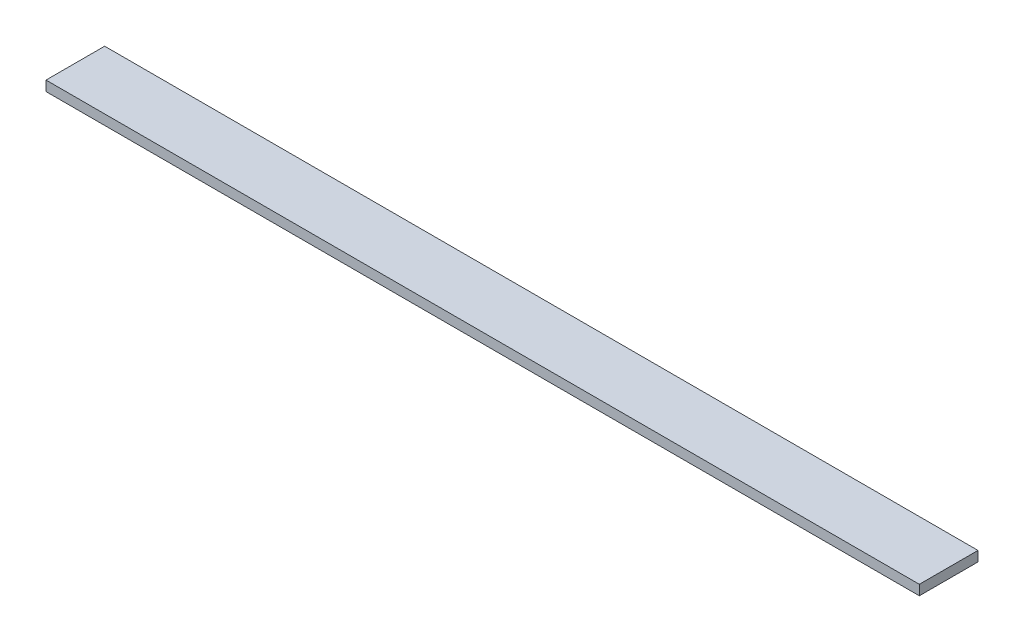
ISO-10303-21;
HEADER;
FILE_DESCRIPTION(('STEP AP214'),'2;1');
FILE_NAME('part.step','',(''),(''),'','','');
FILE_SCHEMA(('AUTOMOTIVE_DESIGN { 1 0 10303 214 1 1 1 1 }'));
ENDSEC;
DATA;
#1=APPLICATION_CONTEXT('core data for automotive mechanical design processes');
#2=APPLICATION_PROTOCOL_DEFINITION('international standard','automotive_design',2000,#1);
#3=PRODUCT_CONTEXT('',#1,'mechanical');
#4=PRODUCT('Part','Part','',(#3));
#5=PRODUCT_RELATED_PRODUCT_CATEGORY('part','',(#4));
#6=PRODUCT_DEFINITION_FORMATION('','',#4);
#7=PRODUCT_DEFINITION_CONTEXT('part definition',#1,'design');
#8=PRODUCT_DEFINITION('design','',#6,#7);
#9=PRODUCT_DEFINITION_SHAPE('','',#8);
#10=(LENGTH_UNIT() NAMED_UNIT(*) SI_UNIT(.MILLI.,.METRE.));
#11=(NAMED_UNIT(*) PLANE_ANGLE_UNIT() SI_UNIT($,.RADIAN.));
#12=(NAMED_UNIT(*) SI_UNIT($,.STERADIAN.) SOLID_ANGLE_UNIT());
#13=UNCERTAINTY_MEASURE_WITH_UNIT(LENGTH_MEASURE(1.E-05),#10,'distance_accuracy_value','');
#14=(GEOMETRIC_REPRESENTATION_CONTEXT(3) GLOBAL_UNCERTAINTY_ASSIGNED_CONTEXT((#13)) GLOBAL_UNIT_ASSIGNED_CONTEXT((#10,
#11,#12)) REPRESENTATION_CONTEXT('',''));
#15=CARTESIAN_POINT('',(0.,0.,0.));
#16=DIRECTION('',(0.,0.,1.));
#17=DIRECTION('',(1.,0.,0.));
#18=AXIS2_PLACEMENT_3D('',#15,#16,#17);
#19=CARTESIAN_POINT('',(-331.,4.6,-63.8630118178));
#20=DIRECTION('',(0.,-1.,0.));
#21=DIRECTION('',(0.,0.,-1.));
#22=AXIS2_PLACEMENT_3D('',#19,#20,#21);
#23=PLANE('',#22);
#24=DIRECTION('',(0.,0.,-1.));
#25=VECTOR('',#24,1.);
#26=CARTESIAN_POINT('',(201.,4.6,13.5));
#27=LINE('',#26,#25);
#28=CARTESIAN_POINT('',(201.,4.6,-13.5));
#29=VERTEX_POINT('',#28);
#30=CARTESIAN_POINT('',(201.,4.6,13.5));
#31=VERTEX_POINT('',#30);
#32=EDGE_CURVE('E76',#29,#31,#27,.F.);
#33=ORIENTED_EDGE('',*,*,#32,.F.);
#34=DIRECTION('',(-1.,0.,0.));
#35=VECTOR('',#34,1.);
#36=CARTESIAN_POINT('',(201.,4.6,-13.5));
#37=LINE('',#36,#35);
#38=CARTESIAN_POINT('',(-201.,4.6,-13.5));
#39=VERTEX_POINT('',#38);
#40=EDGE_CURVE('E58',#39,#29,#37,.F.);
#41=ORIENTED_EDGE('',*,*,#40,.F.);
#42=DIRECTION('',(0.,0.,1.));
#43=VECTOR('',#42,1.);
#44=CARTESIAN_POINT('',(-201.,4.6,-13.5));
#45=LINE('',#44,#43);
#46=CARTESIAN_POINT('',(-201.,4.6,13.5));
#47=VERTEX_POINT('',#46);
#48=EDGE_CURVE('E20',#47,#39,#45,.F.);
#49=ORIENTED_EDGE('',*,*,#48,.F.);
#50=DIRECTION('',(1.,0.,0.));
#51=VECTOR('',#50,1.);
#52=CARTESIAN_POINT('',(-201.,4.6,13.5));
#53=LINE('',#52,#51);
#54=EDGE_CURVE('E55',#31,#47,#53,.F.);
#55=ORIENTED_EDGE('',*,*,#54,.F.);
#56=EDGE_LOOP('',(#33,#41,#49,#55));
#57=FACE_BOUND('',#56,.T.);
#58=ADVANCED_FACE('F17',(#57),#23,.F.);
#59=CARTESIAN_POINT('',(-201.,0.,-13.5));
#60=DIRECTION('',(-1.,0.,0.));
#61=DIRECTION('',(0.,0.,1.));
#62=AXIS2_PLACEMENT_3D('',#59,#60,#61);
#63=PLANE('',#62);
#64=DIRECTION('',(0.,1.,0.));
#65=VECTOR('',#64,1.);
#66=CARTESIAN_POINT('',(-201.,0.,13.5));
#67=LINE('',#66,#65);
#68=CARTESIAN_POINT('',(-201.,0.,13.5));
#69=VERTEX_POINT('',#68);
#70=EDGE_CURVE('E63',#47,#69,#67,.F.);
#71=ORIENTED_EDGE('',*,*,#70,.F.);
#72=ORIENTED_EDGE('',*,*,#48,.T.);
#73=DIRECTION('',(0.,1.,0.));
#74=VECTOR('',#73,1.);
#75=CARTESIAN_POINT('',(-201.,0.,-13.5));
#76=LINE('',#75,#74);
#77=CARTESIAN_POINT('',(-201.,0.,-13.5));
#78=VERTEX_POINT('',#77);
#79=EDGE_CURVE('E79',#78,#39,#76,.T.);
#80=ORIENTED_EDGE('',*,*,#79,.F.);
#81=DIRECTION('',(0.,0.,1.));
#82=VECTOR('',#81,1.);
#83=CARTESIAN_POINT('',(-201.,0.,0.));
#84=LINE('',#83,#82);
#85=EDGE_CURVE('E73',#78,#69,#84,.T.);
#86=ORIENTED_EDGE('',*,*,#85,.T.);
#87=EDGE_LOOP('',(#71,#72,#80,#86));
#88=FACE_BOUND('',#87,.T.);
#89=ADVANCED_FACE('F72',(#88),#63,.T.);
#90=CARTESIAN_POINT('',(-201.,0.,13.5));
#91=DIRECTION('',(0.,0.,1.));
#92=DIRECTION('',(1.,0.,0.));
#93=AXIS2_PLACEMENT_3D('',#90,#91,#92);
#94=PLANE('',#93);
#95=DIRECTION('',(0.,1.,0.));
#96=VECTOR('',#95,1.);
#97=CARTESIAN_POINT('',(201.,0.,13.5));
#98=LINE('',#97,#96);
#99=CARTESIAN_POINT('',(201.,0.,13.5));
#100=VERTEX_POINT('',#99);
#101=EDGE_CURVE('E69',#31,#100,#98,.F.);
#102=ORIENTED_EDGE('',*,*,#101,.F.);
#103=ORIENTED_EDGE('',*,*,#54,.T.);
#104=ORIENTED_EDGE('',*,*,#70,.T.);
#105=DIRECTION('',(1.,0.,0.));
#106=VECTOR('',#105,1.);
#107=CARTESIAN_POINT('',(0.,0.,13.5));
#108=LINE('',#107,#106);
#109=EDGE_CURVE('E83',#69,#100,#108,.T.);
#110=ORIENTED_EDGE('',*,*,#109,.T.);
#111=EDGE_LOOP('',(#102,#103,#104,#110));
#112=FACE_BOUND('',#111,.T.);
#113=ADVANCED_FACE('F66',(#112),#94,.T.);
#114=CARTESIAN_POINT('',(201.,0.,13.5));
#115=DIRECTION('',(1.,0.,0.));
#116=DIRECTION('',(0.,0.,-1.));
#117=AXIS2_PLACEMENT_3D('',#114,#115,#116);
#118=PLANE('',#117);
#119=DIRECTION('',(0.,1.,0.));
#120=VECTOR('',#119,1.);
#121=CARTESIAN_POINT('',(201.,0.,-13.5));
#122=LINE('',#121,#120);
#123=CARTESIAN_POINT('',(201.,0.,-13.5));
#124=VERTEX_POINT('',#123);
#125=EDGE_CURVE('E34',#29,#124,#122,.F.);
#126=ORIENTED_EDGE('',*,*,#125,.F.);
#127=ORIENTED_EDGE('',*,*,#32,.T.);
#128=ORIENTED_EDGE('',*,*,#101,.T.);
#129=DIRECTION('',(0.,0.,1.));
#130=VECTOR('',#129,1.);
#131=CARTESIAN_POINT('',(201.,0.,0.));
#132=LINE('',#131,#130);
#133=EDGE_CURVE('E26',#100,#124,#132,.F.);
#134=ORIENTED_EDGE('',*,*,#133,.T.);
#135=EDGE_LOOP('',(#126,#127,#128,#134));
#136=FACE_BOUND('',#135,.T.);
#137=ADVANCED_FACE('F88',(#136),#118,.T.);
#138=CARTESIAN_POINT('',(201.,0.,-13.5));
#139=DIRECTION('',(0.,0.,-1.));
#140=DIRECTION('',(-1.,0.,0.));
#141=AXIS2_PLACEMENT_3D('',#138,#139,#140);
#142=PLANE('',#141);
#143=ORIENTED_EDGE('',*,*,#79,.T.);
#144=ORIENTED_EDGE('',*,*,#40,.T.);
#145=ORIENTED_EDGE('',*,*,#125,.T.);
#146=DIRECTION('',(1.,0.,0.));
#147=VECTOR('',#146,1.);
#148=CARTESIAN_POINT('',(0.,0.,-13.5));
#149=LINE('',#148,#147);
#150=EDGE_CURVE('E11',#124,#78,#149,.F.);
#151=ORIENTED_EDGE('',*,*,#150,.T.);
#152=EDGE_LOOP('',(#143,#144,#145,#151));
#153=FACE_BOUND('',#152,.T.);
#154=ADVANCED_FACE('F91',(#153),#142,.T.);
#155=CARTESIAN_POINT('',(0.,0.,0.));
#156=DIRECTION('',(0.,1.,0.));
#157=DIRECTION('',(0.,0.,1.));
#158=AXIS2_PLACEMENT_3D('',#155,#156,#157);
#159=PLANE('',#158);
#160=ORIENTED_EDGE('',*,*,#133,.F.);
#161=ORIENTED_EDGE('',*,*,#109,.F.);
#162=ORIENTED_EDGE('',*,*,#85,.F.);
#163=ORIENTED_EDGE('',*,*,#150,.F.);
#164=EDGE_LOOP('',(#160,#161,#162,#163));
#165=FACE_BOUND('',#164,.T.);
#166=ADVANCED_FACE('F90',(#165),#159,.F.);
#167=CLOSED_SHELL('',(#58,#89,#113,#137,#154,#166));
#168=MANIFOLD_SOLID_BREP('B1',#167);
#169=ADVANCED_BREP_SHAPE_REPRESENTATION('',(#18,#168),#14);
#170=SHAPE_DEFINITION_REPRESENTATION(#9,#169);
ENDSEC;
END-ISO-10303-21;
